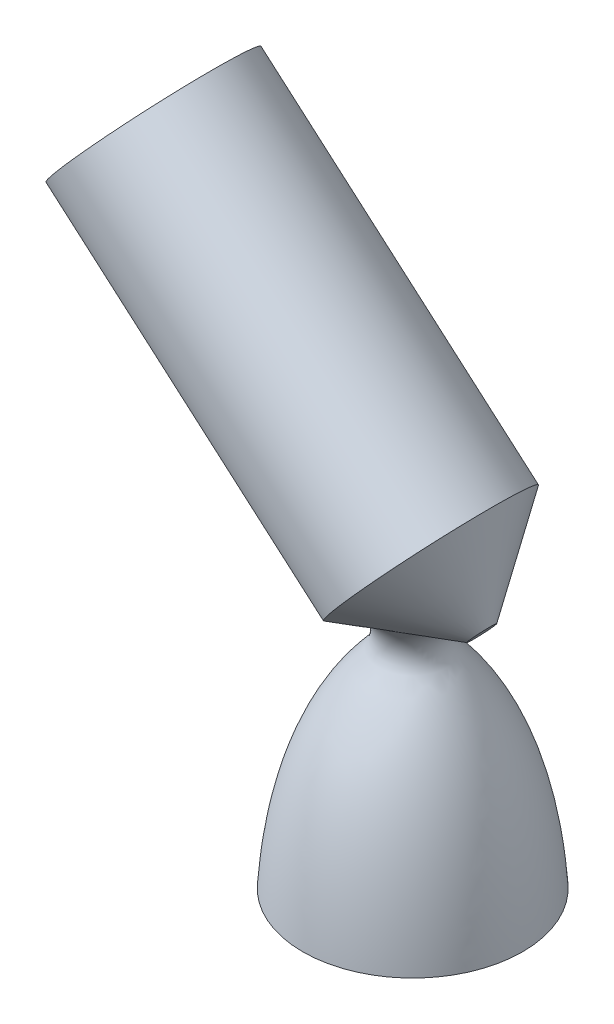
ISO-10303-21;
HEADER;
FILE_DESCRIPTION(('STEP AP214'),'2;1');
FILE_NAME('part.step','',(''),(''),'','','');
FILE_SCHEMA(('AUTOMOTIVE_DESIGN { 1 0 10303 214 1 1 1 1 }'));
ENDSEC;
DATA;
#1=APPLICATION_CONTEXT('core data for automotive mechanical design processes');
#2=APPLICATION_PROTOCOL_DEFINITION('international standard','automotive_design',2000,#1);
#3=PRODUCT_CONTEXT('',#1,'mechanical');
#4=PRODUCT('Part','Part','',(#3));
#5=PRODUCT_RELATED_PRODUCT_CATEGORY('part','',(#4));
#6=PRODUCT_DEFINITION_FORMATION('','',#4);
#7=PRODUCT_DEFINITION_CONTEXT('part definition',#1,'design');
#8=PRODUCT_DEFINITION('design','',#6,#7);
#9=PRODUCT_DEFINITION_SHAPE('','',#8);
#10=(LENGTH_UNIT() NAMED_UNIT(*) SI_UNIT(.MILLI.,.METRE.));
#11=(NAMED_UNIT(*) PLANE_ANGLE_UNIT() SI_UNIT($,.RADIAN.));
#12=(NAMED_UNIT(*) SI_UNIT($,.STERADIAN.) SOLID_ANGLE_UNIT());
#13=UNCERTAINTY_MEASURE_WITH_UNIT(LENGTH_MEASURE(1.E-05),#10,'distance_accuracy_value','');
#14=(GEOMETRIC_REPRESENTATION_CONTEXT(3) GLOBAL_UNCERTAINTY_ASSIGNED_CONTEXT((#13)) GLOBAL_UNIT_ASSIGNED_CONTEXT((#10,
#11,#12)) REPRESENTATION_CONTEXT('',''));
#15=CARTESIAN_POINT('',(0.,0.,0.));
#16=DIRECTION('',(0.,0.,1.));
#17=DIRECTION('',(1.,0.,0.));
#18=AXIS2_PLACEMENT_3D('',#15,#16,#17);
#19=CARTESIAN_POINT('',(1030.06127869613,-216.584436780095,0.));
#20=DIRECTION('',(-0.754774987375658,0.655983779092193,0.));
#21=DIRECTION('',(-0.655983779092193,-0.754774987375658,0.));
#22=AXIS2_PLACEMENT_3D('',#19,#20,#21);
#23=CONICAL_SURFACE('',#22,2.6825178756081,0.855311036249767);
#24=CARTESIAN_POINT('',(1030.06127869613,-216.584436780095,0.));
#25=DIRECTION('',(0.754774987375658,-0.655983779092193,0.));
#26=DIRECTION('',(0.655983779092193,0.754774987375658,0.));
#27=AXIS2_PLACEMENT_3D('',#24,#25,#26);
#28=CIRCLE('',#27,2.68251787560808);
#29=CARTESIAN_POINT('',(1031.82096690965,-214.559739384398,0.));
#30=VERTEX_POINT('',#29);
#31=EDGE_CURVE('E86',#30,#30,#28,.T.);
#32=ORIENTED_EDGE('',*,*,#31,.F.);
#33=EDGE_LOOP('',(#32));
#34=FACE_BOUND('',#33,.T.);
#35=CARTESIAN_POINT('',(1019.16329304601,-207.112869848452,0.));
#36=DIRECTION('',(0.754774987375658,-0.655983779092193,0.));
#37=DIRECTION('',(0.655983779092193,0.754774987375658,0.));
#38=AXIS2_PLACEMENT_3D('',#35,#36,#37);
#39=CIRCLE('',#38,19.2957116731776);
#40=CARTESIAN_POINT('',(1031.82096690965,-192.548949313925,0.));
#41=VERTEX_POINT('',#40);
#42=EDGE_CURVE('E47',#41,#41,#39,.T.);
#43=ORIENTED_EDGE('',*,*,#42,.T.);
#44=EDGE_LOOP('',(#43));
#45=FACE_BOUND('',#44,.T.);
#46=CARTESIAN_POINT('',(1022.99349446706,-219.356217821028,0.));
#47=CARTESIAN_POINT('',(1022.99349339256,-219.356215561703,-0.259237096892169));
#48=CARTESIAN_POINT('',(1022.98643682704,-219.347235291861,-0.518485215306274));
#49=CARTESIAN_POINT('',(1022.95844742382,-219.311863703271,-1.03503931674543));
#50=CARTESIAN_POINT('',(1022.93751268493,-219.285469999034,-1.29234502879238));
#51=CARTESIAN_POINT('',(1022.8822987708,-219.216676448328,-1.80433495924788));
#52=CARTESIAN_POINT('',(1022.84796844627,-219.174215269332,-2.05900524182639));
#53=CARTESIAN_POINT('',(1022.76680014489,-219.075512427907,-2.56357989554313));
#54=CARTESIAN_POINT('',(1022.71996271593,-219.019271369131,-2.8134844749351));
#55=CARTESIAN_POINT('',(1022.62477573909,-218.90758158674,-3.25984914800413));
#56=CARTESIAN_POINT('',(1022.5784898888,-218.854103929661,-3.45725529951725));
#57=CARTESIAN_POINT('',(1022.47848991457,-218.74122242887,-3.84850969982976));
#58=CARTESIAN_POINT('',(1022.42477386636,-218.681817051113,-4.04235701218307));
#59=CARTESIAN_POINT('',(1022.30984932292,-218.558463788513,-4.42651853701961));
#60=CARTESIAN_POINT('',(1022.24863510907,-218.494512452403,-4.61682992375915));
#61=CARTESIAN_POINT('',(1022.11840925952,-218.363723070944,-4.9934081617634));
#62=CARTESIAN_POINT('',(1022.04940916818,-218.296889387932,-5.17968052534436));
#63=CARTESIAN_POINT('',(1021.90255345865,-218.162023563338,-5.54814090348343));
#64=CARTESIAN_POINT('',(1021.82470377286,-218.093992250149,-5.73033155731195));
#65=CARTESIAN_POINT('',(1021.6997876261,-217.992790596739,-6.00004373217154));
#66=CARTESIAN_POINT('',(1021.65681305839,-217.959212460184,-6.08931294189839));
#67=CARTESIAN_POINT('',(1021.56774566427,-217.892716061115,-6.26652672503485));
#68=CARTESIAN_POINT('',(1021.52165319317,-217.859797723963,-6.3544714479886));
#69=CARTESIAN_POINT('',(1021.42432712157,-217.794047614292,-6.53160333071094));
#70=CARTESIAN_POINT('',(1021.37297607523,-217.761252449016,-6.62073993542854));
#71=CARTESIAN_POINT('',(1021.26575059014,-217.697513396887,-6.79696933629235));
#72=CARTESIAN_POINT('',(1021.20987560504,-217.666569734431,-6.8840618839296));
#73=CARTESIAN_POINT('',(1021.09294627433,-217.607454530227,-7.05536463184412));
#74=CARTESIAN_POINT('',(1021.03190502086,-217.579276350187,-7.13958140139045));
#75=CARTESIAN_POINT('',(1020.90365961747,-217.526664362348,-7.30443312871749));
#76=CARTESIAN_POINT('',(1020.83645779718,-217.502229148399,-7.38506942347893));
#77=CARTESIAN_POINT('',(1020.71376363298,-217.464126430573,-7.52085681894281));
#78=CARTESIAN_POINT('',(1020.65985891376,-217.449318860309,-7.57711941273951));
#79=CARTESIAN_POINT('',(1020.5480990226,-217.422913445915,-7.68639451973838));
#80=CARTESIAN_POINT('',(1020.49024437252,-217.411315178795,-7.73940746053178));
#81=CARTESIAN_POINT('',(1020.37068323033,-217.391805065865,-7.84142519479688));
#82=CARTESIAN_POINT('',(1020.30898386129,-217.383886619997,-7.89043703334951));
#83=CARTESIAN_POINT('',(1020.18187379881,-217.372030091944,-7.98393140271144));
#84=CARTESIAN_POINT('',(1020.11646321846,-217.368091888543,-8.02841407141685));
#85=CARTESIAN_POINT('',(1019.98219475836,-217.36430961519,-8.11250310822706));
#86=CARTESIAN_POINT('',(1019.91332720704,-217.364477753118,-8.15209458440643));
#87=CARTESIAN_POINT('',(1019.77295047904,-217.368827257063,-8.22601130502301));
#88=CARTESIAN_POINT('',(1019.70144120101,-217.373008777209,-8.26033634715069));
#89=CARTESIAN_POINT('',(1019.55631307832,-217.385091206607,-8.32380354846559));
#90=CARTESIAN_POINT('',(1019.48269044369,-217.392999248172,-8.35293562065253));
#91=CARTESIAN_POINT('',(1019.33406035335,-217.412113598763,-8.40618012406228));
#92=CARTESIAN_POINT('',(1019.25905236813,-217.423321194476,-8.43029059079771));
#93=CARTESIAN_POINT('',(1019.06829399188,-217.455239846596,-8.48535767168084));
#94=CARTESIAN_POINT('',(1018.95195910494,-217.47784323239,-8.51319947223688));
#95=CARTESIAN_POINT('',(1018.7185169044,-217.528094512036,-8.55947982735637));
#96=CARTESIAN_POINT('',(1018.60140914267,-217.555745636664,-8.57791233070323));
#97=CARTESIAN_POINT('',(1018.36685929654,-217.614889692231,-8.60679808012007));
#98=CARTESIAN_POINT('',(1018.24941719675,-217.646393193122,-8.61722877469028));
#99=CARTESIAN_POINT('',(1018.01489068103,-217.712215699559,-8.63117880586247));
#100=CARTESIAN_POINT('',(1017.89780642276,-217.746535800306,-8.63469544062492));
#101=CARTESIAN_POINT('',(1017.66305989632,-217.817621263859,-8.63571036141046));
#102=CARTESIAN_POINT('',(1017.54540402595,-217.854408105132,-8.63314651893483));
#103=CARTESIAN_POINT('',(1017.31087014358,-217.929552377583,-8.62256875436628));
#104=CARTESIAN_POINT('',(1017.19399203185,-217.967909602695,-8.61455554519755));
#105=CARTESIAN_POINT('',(1016.96097561585,-218.04582408813,-8.59359209303997));
#106=CARTESIAN_POINT('',(1016.84483802859,-218.08538234528,-8.5806376397901));
#107=CARTESIAN_POINT('',(1016.61345550727,-218.165362085063,-8.55017710985072));
#108=CARTESIAN_POINT('',(1016.49821067782,-218.205783666818,-8.53267050790031));
#109=CARTESIAN_POINT('',(1016.1537347615,-218.328027652117,-8.4737454190955));
#110=CARTESIAN_POINT('',(1015.92590306642,-218.410781618994,-8.42593507715824));
#111=CARTESIAN_POINT('',(1015.47459081024,-218.577323605123,-8.31481261158674));
#112=CARTESIAN_POINT('',(1015.25110877065,-218.661111256616,-8.25150585827947));
#113=CARTESIAN_POINT('',(1014.78533558715,-218.83776378414,-8.10260477377591));
#114=CARTESIAN_POINT('',(1014.54357798478,-218.93064445863,-8.01535426949988));
#115=CARTESIAN_POINT('',(1014.06678309548,-219.115582170689,-7.82327601985215));
#116=CARTESIAN_POINT('',(1013.83174681552,-219.20763908344,-7.71844565670338));
#117=CARTESIAN_POINT('',(1013.36979245613,-219.389952830968,-7.49150413634889));
#118=CARTESIAN_POINT('',(1013.14286573499,-219.480211533621,-7.36941210586314));
#119=CARTESIAN_POINT('',(1012.69810834538,-219.658226266808,-7.10783450159455));
#120=CARTESIAN_POINT('',(1012.48028061221,-219.745981486881,-6.96834337192283));
#121=CARTESIAN_POINT('',(1012.06063306728,-219.915951215713,-6.6756790476523));
#122=CARTESIAN_POINT('',(1011.85854967599,-219.998249287613,-6.52293317300658));
#123=CARTESIAN_POINT('',(1011.46621918401,-220.158752994539,-6.20098979919189));
#124=CARTESIAN_POINT('',(1011.27597041412,-220.236959206448,-6.03179462876353));
#125=CARTESIAN_POINT('',(1010.90916514143,-220.38834190612,-5.6772004909311));
#126=CARTESIAN_POINT('',(1010.73260352648,-220.461520270602,-5.49180762890446));
#127=CARTESIAN_POINT('',(1010.39512455474,-220.601883814613,-5.10518497003586));
#128=CARTESIAN_POINT('',(1010.23420431569,-220.669070098116,-4.90395810334389));
#129=CARTESIAN_POINT('',(1009.95508477834,-220.78595888896,-4.52068217080164));
#130=CARTESIAN_POINT('',(1009.83420792812,-220.836721434632,-4.34090280198868));
#131=CARTESIAN_POINT('',(1009.60615224999,-220.932704671719,-3.97146365952528));
#132=CARTESIAN_POINT('',(1009.49897086931,-220.977926395849,-3.78180573648955));
#133=CARTESIAN_POINT('',(1009.29959233851,-221.062202706304,-3.39351790722499));
#134=CARTESIAN_POINT('',(1009.2073904041,-221.101259261615,-3.19489089164687));
#135=CARTESIAN_POINT('',(1009.03914485045,-221.172633296819,-2.78971534886551));
#136=CARTESIAN_POINT('',(1008.96310144211,-221.20495068876,-2.58316671832025));
#137=CARTESIAN_POINT('',(1008.82790730378,-221.262470673309,-2.16235091818354));
#138=CARTESIAN_POINT('',(1008.76885212807,-221.287633011871,-1.94804743905759));
#139=CARTESIAN_POINT('',(1008.66913671578,-221.330152280518,-1.51442818570657));
#140=CARTESIAN_POINT('',(1008.62847663281,-221.34750914542,-1.29511236964003));
#141=CARTESIAN_POINT('',(1008.56624748738,-221.374083959495,-0.853362913582975));
#142=CARTESIAN_POINT('',(1008.54467261758,-221.383304384454,-0.630930242942619));
#143=CARTESIAN_POINT('',(1008.52097362464,-221.393432961385,-0.184850773307888));
#144=CARTESIAN_POINT('',(1008.51884786524,-221.394341812614,0.0387959219659905));
#145=CARTESIAN_POINT('',(1008.53335268284,-221.388142258,0.464100781839694));
#146=CARTESIAN_POINT('',(1008.54822341694,-221.381786082068,0.665832595299747));
#147=CARTESIAN_POINT('',(1008.59370384167,-221.36235746404,1.06717313419611));
#148=CARTESIAN_POINT('',(1008.6243123616,-221.34928552151,1.26678201642415));
#149=CARTESIAN_POINT('',(1008.70083515092,-221.316632894846,1.66247237838037));
#150=CARTESIAN_POINT('',(1008.74674791843,-221.297052849384,1.85855420224689));
#151=CARTESIAN_POINT('',(1008.85326603437,-221.251678768255,2.24594537625596));
#152=CARTESIAN_POINT('',(1008.91387182415,-221.225884545932,2.4372545828514));
#153=CARTESIAN_POINT('',(1009.0493095551,-221.168323656485,2.81479678116241));
#154=CARTESIAN_POINT('',(1009.12420265048,-221.136531322234,3.00100386577156));
#155=CARTESIAN_POINT('',(1009.28719046043,-221.067461668445,3.36655900504982));
#156=CARTESIAN_POINT('',(1009.37528981133,-221.030182422696,3.54590462299036));
#157=CARTESIAN_POINT('',(1009.56373188373,-220.95060324019,3.8968820041055));
#158=CARTESIAN_POINT('',(1009.66407527223,-220.908303029916,4.06851334634123));
#159=CARTESIAN_POINT('',(1009.87603576944,-220.81915457768,4.40343773909482));
#160=CARTESIAN_POINT('',(1009.98765427946,-220.772305770427,4.5667297493604));
#161=CARTESIAN_POINT('',(1010.23450181323,-220.668963891144,4.90259589373847));
#162=CARTESIAN_POINT('',(1010.37097196587,-220.611980149728,5.07410794629525));
#163=CARTESIAN_POINT('',(1010.65535816408,-220.493612512019,5.40569671733633));
#164=CARTESIAN_POINT('',(1010.803275078,-220.432228281933,5.56577256649871));
#165=CARTESIAN_POINT('',(1011.26228359338,-220.242409375166,6.02837527648041));
#166=CARTESIAN_POINT('',(1011.58877068896,-220.108250637351,6.31346182142725));
#167=CARTESIAN_POINT('',(1012.33637901395,-219.8037190897,6.88366239345927));
#168=CARTESIAN_POINT('',(1012.76388552624,-219.631211447505,7.15923822774098));
#169=CARTESIAN_POINT('',(1013.42993598005,-219.366141117446,7.5225936440326));
#170=CARTESIAN_POINT('',(1013.65642750096,-219.276599811975,7.63550333666928));
#171=CARTESIAN_POINT('',(1014.11656523235,-219.096201023289,7.84450274568968));
#172=CARTESIAN_POINT('',(1014.3502105981,-219.005343696134,7.94059443903395));
#173=CARTESIAN_POINT('',(1014.82338048949,-218.823283247716,8.1155852229152));
#174=CARTESIAN_POINT('',(1015.062898611,-218.732080587469,8.19450218883562));
#175=CARTESIAN_POINT('',(1015.54728837173,-218.550241646464,8.33465329000249));
#176=CARTESIAN_POINT('',(1015.79215937672,-218.459605300224,8.3958895080649));
#177=CARTESIAN_POINT('',(1016.16257067827,-218.325310398535,8.47336520383497));
#178=CARTESIAN_POINT('',(1016.28636768827,-218.280888431592,8.49676923642283));
#179=CARTESIAN_POINT('',(1016.53506567911,-218.192794115057,8.53855656716046));
#180=CARTESIAN_POINT('',(1016.65996652994,-218.149121678922,8.55694044866204));
#181=CARTESIAN_POINT('',(1016.91071716747,-218.062867961662,8.58830062046464));
#182=CARTESIAN_POINT('',(1017.03656617035,-218.020285885057,8.60128096493251));
#183=CARTESIAN_POINT('',(1017.28921196315,-217.936598470608,8.62133064553199));
#184=CARTESIAN_POINT('',(1017.41600857161,-217.895492858357,8.62840108554304));
#185=CARTESIAN_POINT('',(1017.64254260499,-217.82411310336,8.63508782982198));
#186=CARTESIAN_POINT('',(1017.7421159191,-217.793440547349,8.63599882531395));
#187=CARTESIAN_POINT('',(1017.9416834841,-217.733700082157,8.63332457232698));
#188=CARTESIAN_POINT('',(1018.04167769461,-217.704632022611,8.62973974592378));
#189=CARTESIAN_POINT('',(1018.24216309694,-217.648501529951,8.61749003590575));
#190=CARTESIAN_POINT('',(1018.34265489432,-217.621443520513,8.608814300917));
#191=CARTESIAN_POINT('',(1018.5436854234,-217.570004346819,8.58565746600649));
#192=CARTESIAN_POINT('',(1018.64422415856,-217.5456234298,8.57117583046671));
#193=CARTESIAN_POINT('',(1018.84678602809,-217.499891863106,8.53522158464344));
#194=CARTESIAN_POINT('',(1018.9488022374,-217.478605577361,8.51362466396454));
#195=CARTESIAN_POINT('',(1019.15174067748,-217.440608409667,8.46251605600738));
#196=CARTESIAN_POINT('',(1019.25266294363,-217.423897379354,8.43300462543593));
#197=CARTESIAN_POINT('',(1019.45174644898,-217.396248627108,8.36531768939818));
#198=CARTESIAN_POINT('',(1019.54992047556,-217.385277387319,8.32719438914498));
#199=CARTESIAN_POINT('',(1019.74264848825,-217.3699916211,8.2416041069896));
#200=CARTESIAN_POINT('',(1019.83720423245,-217.365673820716,8.19414173353506));
#201=CARTESIAN_POINT('',(1020.00805730599,-217.364400928232,8.09738061537591));
#202=CARTESIAN_POINT('',(1020.08504003452,-217.366486915159,8.04930086636198));
#203=CARTESIAN_POINT('',(1020.23436251567,-217.375997961603,7.94688118571328));
#204=CARTESIAN_POINT('',(1020.30670241824,-217.383422848604,7.89254145640437));
#205=CARTESIAN_POINT('',(1020.4464757843,-217.403261050641,7.77829325100099));
#206=CARTESIAN_POINT('',(1020.51389246357,-217.415690567808,7.71836717848662));
#207=CARTESIAN_POINT('',(1020.64350312052,-217.444875685233,7.59410394009343));
#208=CARTESIAN_POINT('',(1020.7056958815,-217.461632289611,7.52976575291146));
#209=CARTESIAN_POINT('',(1020.85162187039,-217.506922115944,7.36831552215169));
#210=CARTESIAN_POINT('',(1020.93267112279,-217.537381975152,7.26932623098689));
#211=CARTESIAN_POINT('',(1021.08589796739,-217.603493574475,7.06636712883734));
#212=CARTESIAN_POINT('',(1021.15806930359,-217.639148937491,6.9623938766921));
#213=CARTESIAN_POINT('',(1021.29535520109,-217.714012293786,6.75052383084062));
#214=CARTESIAN_POINT('',(1021.36044004448,-217.753234070811,6.64261287069005));
#215=CARTESIAN_POINT('',(1021.48454560128,-217.833753641283,6.4241838456951));
#216=CARTESIAN_POINT('',(1021.543567745,-217.875050941633,6.31366640337243));
#217=CARTESIAN_POINT('',(1021.64458904588,-217.949850200418,6.11422592435102));
#218=CARTESIAN_POINT('',(1021.68754083878,-217.983144406426,6.02570315069869));
#219=CARTESIAN_POINT('',(1021.77071030262,-218.050043144606,5.84749492180896));
#220=CARTESIAN_POINT('',(1021.81092780198,-218.083647696104,5.75780939402691));
#221=CARTESIAN_POINT('',(1021.92798506167,-218.184490427019,5.48705819223911));
#222=CARTESIAN_POINT('',(1022.00117669492,-218.251717148072,5.30440413124814));
#223=CARTESIAN_POINT('',(1022.13937206588,-218.384186013737,4.93522640589782));
#224=CARTESIAN_POINT('',(1022.20437163789,-218.449427135975,4.74870082854864));
#225=CARTESIAN_POINT('',(1022.3267800988,-218.576236991751,4.37223417199388));
#226=CARTESIAN_POINT('',(1022.38419867909,-218.637810357676,4.18229781315574));
#227=CARTESIAN_POINT('',(1022.49174767568,-218.75591975203,3.79894360287884));
#228=CARTESIAN_POINT('',(1022.54188216786,-218.812458590674,3.60552776704757));
#229=CARTESIAN_POINT('',(1022.63479969541,-218.919162722606,3.21525436862446));
#230=CARTESIAN_POINT('',(1022.67758482322,-218.96932982894,3.01839780329501));
#231=CARTESIAN_POINT('',(1022.76144357017,-219.069006866172,2.59126728241086));
#232=CARTESIAN_POINT('',(1022.80127470141,-219.117264512596,2.36045100208884));
#233=CARTESIAN_POINT('',(1022.87021304544,-219.2016720546,1.89500493755356));
#234=CARTESIAN_POINT('',(1022.8993204244,-219.237822137783,1.66037521248763));
#235=CARTESIAN_POINT('',(1022.94611984949,-219.296303570024,1.18888036952914));
#236=CARTESIAN_POINT('',(1022.96384213325,-219.318671516477,0.952022882314719));
#237=CARTESIAN_POINT('',(1022.98752985551,-219.348629579537,0.476780022916662));
#238=CARTESIAN_POINT('',(1022.99349545517,-219.356219898705,0.238394671720658));
#239=CARTESIAN_POINT('',(1022.99349446706,-219.356217821028,0.));
#240=B_SPLINE_CURVE_WITH_KNOTS('',3,(#46,#47,#48,#49,#50,#51,#52,#53,#54,#55,#56,#57,#58,#59,
#60,#61,#62,#63,#64,#65,#66,#67,#68,#69,#70,#71,#72,#73,#74,#75,#76,#77,#78,#79,#80,#81,#82,#83,
#84,#85,#86,#87,#88,#89,#90,#91,#92,#93,#94,#95,#96,#97,#98,#99,#100,#101,#102,#103,#104,#105,
#106,#107,#108,#109,#110,#111,#112,#113,#114,#115,#116,#117,#118,#119,#120,#121,#122,#123,#124,
#125,#126,#127,#128,#129,#130,#131,#132,#133,#134,#135,#136,#137,#138,#139,#140,#141,#142,#143,
#144,#145,#146,#147,#148,#149,#150,#151,#152,#153,#154,#155,#156,#157,#158,#159,#160,#161,#162,
#163,#164,#165,#166,#167,#168,#169,#170,#171,#172,#173,#174,#175,#176,#177,#178,#179,#180,#181,
#182,#183,#184,#185,#186,#187,#188,#189,#190,#191,#192,#193,#194,#195,#196,#197,#198,#199,#200,
#201,#202,#203,#204,#205,#206,#207,#208,#209,#210,#211,#212,#213,#214,#215,#216,#217,#218,#219,
#220,#221,#222,#223,#224,#225,#226,#227,#228,#229,#230,#231,#232,#233,#234,#235,#236,#237,#238,
#239),.UNSPECIFIED.,.T.,.F.,(4,2,2,2,2,2,2,2,2,2,2,2,2,2,2,2,2,2,2,2,2,2,2,2,2,2,2,2,2,2,2,2,2,
2,2,2,2,2,2,2,2,2,2,2,2,2,2,2,2,2,2,2,2,2,2,2,2,2,2,2,2,2,2,2,2,2,2,2,2,2,2,2,2,2,2,2,2,2,2,2,2,
2,2,2,2,2,2,2,2,2,2,2,2,2,2,2,4),(0.,0.777487251868038,1.55508103483018,2.33567347938787,
3.11623173475649,3.74506167399238,4.37405477345694,5.00353060912831,5.63208507088247,
6.2602206341682,6.57400724004074,6.88775814743787,7.21156749177429,7.53541600184462,
7.85846708647344,8.18139650871524,8.41913741693539,8.65684697562258,8.89412852149513,
9.13140284087924,9.36938264667019,9.60737159214347,9.84581789414326,10.0843573035238,
10.4489475601398,10.8137719940653,11.1796208733967,11.5456126888161,11.9153601843646,
12.2850593162675,12.6550741620904,13.0251317219506,13.7656936032344,14.5059992030635,
15.3251967413648,16.1445163730136,16.9629351740755,17.7816159852966,18.5799056662027,
19.3780824966838,20.1759597586299,20.97368971567,21.6405466779538,22.3072791597242,
22.9737982727944,23.6403260839489,24.31053273868,24.9807449901384,25.6507532366346,
26.3207051145165,26.9271146548413,27.5334790925952,28.1397840423267,28.7461072060984,
29.3550863466514,29.9642797849804,30.5735064244366,31.1828088744202,31.8615303809251,
32.5403034256072,33.8971440270566,35.5022338872166,36.3070922114647,37.1118558607526,
37.9157778666815,38.7196051308384,39.1203001119993,39.5209485117519,39.9212957687955,
40.3215682303955,40.6340577852157,40.9465180051569,41.2596466721017,41.5728042330941,
41.8917519927576,42.2106894086143,42.5277429747245,42.8446404785609,43.1165137203515,
43.3883781775201,43.6611299454951,43.9339450637483,44.3277888791457,44.7219086537503,
45.1176222505338,45.5132422750847,45.8248161090184,46.1364094766099,46.7599719367959,
47.3838502134659,48.0069230511265,48.6296458873776,49.2521911319031,49.9691019998012,
50.6860017588549,51.4009895482516,52.1159675371201),.UNSPECIFIED.);
#241=CARTESIAN_POINT('',(1022.99349446706,-219.356217821028,0.));
#242=VERTEX_POINT('',#241);
#243=EDGE_CURVE('E39',#242,#242,#240,.T.);
#244=ORIENTED_EDGE('',*,*,#243,.T.);
#245=EDGE_LOOP('',(#244));
#246=FACE_BOUND('',#245,.T.);
#247=ADVANCED_FACE('F35',(#34,#45,#246),#23,.T.);
#248=CARTESIAN_POINT('',(1030.06127869613,-216.584436780095,0.));
#249=DIRECTION('',(0.754774987375658,-0.655983779092193,0.));
#250=DIRECTION('',(0.655983779092193,0.754774987375658,0.));
#251=AXIS2_PLACEMENT_3D('',#248,#249,#250);
#252=PLANE('',#251);
#253=ORIENTED_EDGE('',*,*,#31,.T.);
#254=EDGE_LOOP('',(#253));
#255=FACE_BOUND('',#254,.T.);
#256=ADVANCED_FACE('F37',(#255),#252,.T.);
#257=CARTESIAN_POINT('',(959.657201147802,-155.395428630483,0.));
#258=DIRECTION('',(-0.754774987375658,0.655983779092193,0.));
#259=DIRECTION('',(-0.655983779092193,-0.754774987375658,0.));
#260=AXIS2_PLACEMENT_3D('',#257,#258,#259);
#261=PLANE('',#260);
#262=CARTESIAN_POINT('',(959.657201147802,-155.395428630483,0.));
#263=DIRECTION('',(0.754774987375658,-0.655983779092193,0.));
#264=DIRECTION('',(0.655983779092193,0.754774987375658,0.));
#265=AXIS2_PLACEMENT_3D('',#262,#263,#264);
#266=CIRCLE('',#265,19.295711673176);
#267=CARTESIAN_POINT('',(972.314875011446,-140.831508095957,0.));
#268=VERTEX_POINT('',#267);
#269=EDGE_CURVE('E11',#268,#268,#266,.T.);
#270=ORIENTED_EDGE('',*,*,#269,.F.);
#271=EDGE_LOOP('',(#270));
#272=FACE_BOUND('',#271,.T.);
#273=ADVANCED_FACE('F67',(#272),#261,.T.);
#274=CARTESIAN_POINT('',(1030.06127869613,-216.584436780095,0.));
#275=DIRECTION('',(0.754774987375658,-0.655983779092193,0.));
#276=DIRECTION('',(0.655983779092193,0.754774987375658,0.));
#277=AXIS2_PLACEMENT_3D('',#274,#275,#276);
#278=CYLINDRICAL_SURFACE('',#277,19.2957116731768);
#279=ORIENTED_EDGE('',*,*,#269,.T.);
#280=EDGE_LOOP('',(#279));
#281=FACE_BOUND('',#280,.T.);
#282=ORIENTED_EDGE('',*,*,#42,.F.);
#283=EDGE_LOOP('',(#282));
#284=FACE_BOUND('',#283,.T.);
#285=ADVANCED_FACE('F75',(#281,#284),#278,.T.);
#286=CARTESIAN_POINT('',(1038.82891899215,-271.394527399758,0.));
#287=CARTESIAN_POINT('',(1037.87344817367,-256.436961097566,0.));
#288=CARTESIAN_POINT('',(1033.93242354103,-239.028318184265,0.));
#289=CARTESIAN_POINT('',(1022.04554777996,-226.197270808975,0.));
#290=CARTESIAN_POINT('',(1021.38555819383,-223.249921116104,0.));
#291=CARTESIAN_POINT('',(1023.4616464398,-215.880421657401,0.));
#292=CARTESIAN_POINT('',(1031.8025418422,-213.509952536896,0.));
#293=CARTESIAN_POINT('',(1030.50056889935,-206.266042018992,0.));
#294=B_SPLINE_CURVE_WITH_KNOTS('',3,(#286,#287,#288,#289,#290,#291,#292,#293),.UNSPECIFIED.,.F.,
.F.,(4,1,1,1,1,4),(0.,0.648973555181531,0.689713178005749,0.72594880212695,0.770741806940718,
1.),.UNSPECIFIED.);
#295=CARTESIAN_POINT('',(1015.25039122994,-199.885877629069,0.));
#296=DIRECTION('',(0.,1.,0.));
#297=AXIS1_PLACEMENT('',#295,#296);
#298=SURFACE_OF_REVOLUTION('',#294,#297);
#299=ORIENTED_EDGE('',*,*,#243,.F.);
#300=EDGE_LOOP('',(#299));
#301=FACE_BOUND('',#300,.T.);
#302=CARTESIAN_POINT('',(1015.25039122994,-271.394527399758,0.));
#303=DIRECTION('',(0.,1.,0.));
#304=DIRECTION('',(0.,0.,1.));
#305=AXIS2_PLACEMENT_3D('',#302,#303,#304);
#306=CIRCLE('',#305,23.5785277622114);
#307=CARTESIAN_POINT('',(1015.25039122994,-271.394527399758,23.5785277622114));
#308=VERTEX_POINT('',#307);
#309=EDGE_CURVE('E91',#308,#308,#306,.T.);
#310=ORIENTED_EDGE('',*,*,#309,.T.);
#311=EDGE_LOOP('',(#310));
#312=FACE_BOUND('',#311,.T.);
#313=ADVANCED_FACE('F58',(#301,#312),#298,.T.);
#314=CARTESIAN_POINT('',(1034.96358657213,-271.394527399758,0.));
#315=DIRECTION('',(0.,1.,0.));
#316=DIRECTION('',(0.,0.,1.));
#317=AXIS2_PLACEMENT_3D('',#314,#315,#316);
#318=PLANE('',#317);
#319=ORIENTED_EDGE('',*,*,#309,.F.);
#320=EDGE_LOOP('',(#319));
#321=FACE_BOUND('',#320,.T.);
#322=CARTESIAN_POINT('',(1015.25039122994,-271.394527399758,0.));
#323=DIRECTION('',(0.,1.,0.));
#324=DIRECTION('',(0.,0.,1.));
#325=AXIS2_PLACEMENT_3D('',#322,#323,#324);
#326=CIRCLE('',#325,19.7131953421916);
#327=CARTESIAN_POINT('',(1015.25039122994,-271.394527399758,19.7131953421916));
#328=VERTEX_POINT('',#327);
#329=EDGE_CURVE('E94',#328,#328,#326,.T.);
#330=ORIENTED_EDGE('',*,*,#329,.T.);
#331=EDGE_LOOP('',(#330));
#332=FACE_BOUND('',#331,.T.);
#333=ADVANCED_FACE('F52',(#321,#332),#318,.F.);
#334=CARTESIAN_POINT('',(1015.25039122994,-232.741203199386,0.));
#335=DIRECTION('',(0.,-1.,0.));
#336=DIRECTION('',(0.,0.,-1.));
#337=AXIS2_PLACEMENT_3D('',#334,#335,#336);
#338=CONICAL_SURFACE('',#337,0.,0.471615567862362);
#339=ORIENTED_EDGE('',*,*,#329,.F.);
#340=EDGE_LOOP('',(#339));
#341=FACE_BOUND('',#340,.T.);
#342=CARTESIAN_POINT('',(1015.25039122994,-232.741203199386,0.));
#343=VERTEX_POINT('',#342);
#344=VERTEX_LOOP('',#343);
#345=FACE_BOUND('',#344,.T.);
#346=ADVANCED_FACE('F50',(#341,#345),#338,.F.);
#347=CLOSED_SHELL('',(#247,#256,#273,#285,#313,#333,#346));
#348=MANIFOLD_SOLID_BREP('B2',#347);
#349=ADVANCED_BREP_SHAPE_REPRESENTATION('',(#18,#348),#14);
#350=SHAPE_DEFINITION_REPRESENTATION(#9,#349);
ENDSEC;
END-ISO-10303-21;
